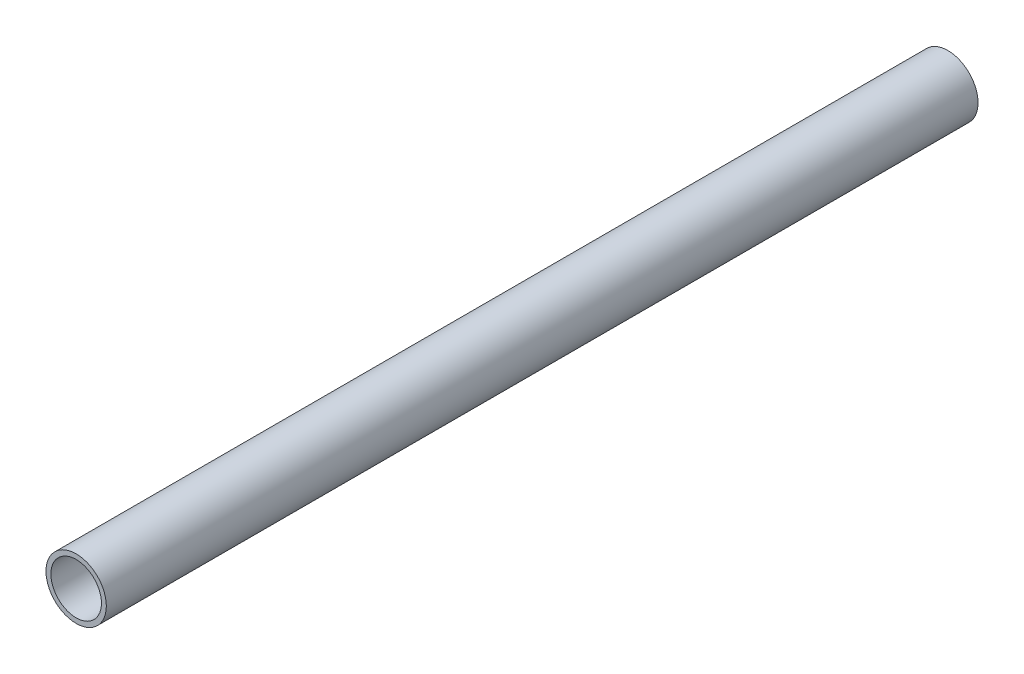
ISO-10303-21;
HEADER;
FILE_DESCRIPTION(('STEP AP214'),'2;1');
FILE_NAME('part.step','',(''),(''),'','','');
FILE_SCHEMA(('AUTOMOTIVE_DESIGN { 1 0 10303 214 1 1 1 1 }'));
ENDSEC;
DATA;
#1=APPLICATION_CONTEXT('core data for automotive mechanical design processes');
#2=APPLICATION_PROTOCOL_DEFINITION('international standard','automotive_design',2000,#1);
#3=PRODUCT_CONTEXT('',#1,'mechanical');
#4=PRODUCT('Part','Part','',(#3));
#5=PRODUCT_RELATED_PRODUCT_CATEGORY('part','',(#4));
#6=PRODUCT_DEFINITION_FORMATION('','',#4);
#7=PRODUCT_DEFINITION_CONTEXT('part definition',#1,'design');
#8=PRODUCT_DEFINITION('design','',#6,#7);
#9=PRODUCT_DEFINITION_SHAPE('','',#8);
#10=(LENGTH_UNIT() NAMED_UNIT(*) SI_UNIT(.MILLI.,.METRE.));
#11=(NAMED_UNIT(*) PLANE_ANGLE_UNIT() SI_UNIT($,.RADIAN.));
#12=(NAMED_UNIT(*) SI_UNIT($,.STERADIAN.) SOLID_ANGLE_UNIT());
#13=UNCERTAINTY_MEASURE_WITH_UNIT(LENGTH_MEASURE(1.E-05),#10,'distance_accuracy_value','');
#14=(GEOMETRIC_REPRESENTATION_CONTEXT(3) GLOBAL_UNCERTAINTY_ASSIGNED_CONTEXT((#13)) GLOBAL_UNIT_ASSIGNED_CONTEXT((#10,
#11,#12)) REPRESENTATION_CONTEXT('',''));
#15=CARTESIAN_POINT('',(0.,0.,0.));
#16=DIRECTION('',(0.,0.,1.));
#17=DIRECTION('',(1.,0.,0.));
#18=AXIS2_PLACEMENT_3D('',#15,#16,#17);
#19=CARTESIAN_POINT('',(0.,0.,258.036036458149));
#20=DIRECTION('',(0.,0.,-1.));
#21=DIRECTION('',(-1.,0.,0.));
#22=AXIS2_PLACEMENT_3D('',#19,#20,#21);
#23=CYLINDRICAL_SURFACE('',#22,8.35);
#24=CARTESIAN_POINT('',(0.,0.,-6.92840654131192));
#25=DIRECTION('',(0.,0.,-1.));
#26=DIRECTION('',(-1.,0.,0.));
#27=AXIS2_PLACEMENT_3D('',#24,#25,#26);
#28=CIRCLE('',#27,8.35);
#29=CARTESIAN_POINT('',(-8.35,0.,-6.92840654131192));
#30=VERTEX_POINT('',#29);
#31=EDGE_CURVE('E41',#30,#30,#28,.T.);
#32=ORIENTED_EDGE('',*,*,#31,.F.);
#33=EDGE_LOOP('',(#32));
#34=FACE_BOUND('',#33,.T.);
#35=CARTESIAN_POINT('',(0.,0.,234.418669966519));
#36=DIRECTION('',(0.,0.,1.));
#37=DIRECTION('',(1.,0.,0.));
#38=AXIS2_PLACEMENT_3D('',#35,#36,#37);
#39=CIRCLE('',#38,8.35);
#40=CARTESIAN_POINT('',(8.35000000000002,0.,234.418669966519));
#41=VERTEX_POINT('',#40);
#42=EDGE_CURVE('E37',#41,#41,#39,.F.);
#43=ORIENTED_EDGE('',*,*,#42,.T.);
#44=EDGE_LOOP('',(#43));
#45=FACE_BOUND('',#44,.T.);
#46=ADVANCED_FACE('F33',(#34,#45),#23,.T.);
#47=CARTESIAN_POINT('',(0.,0.,258.036036458149));
#48=DIRECTION('',(0.,0.,-1.));
#49=DIRECTION('',(-1.,0.,0.));
#50=AXIS2_PLACEMENT_3D('',#47,#48,#49);
#51=CYLINDRICAL_SURFACE('',#50,7.);
#52=CARTESIAN_POINT('',(0.,0.,-6.92840654131192));
#53=DIRECTION('',(0.,0.,-1.));
#54=DIRECTION('',(-1.,0.,0.));
#55=AXIS2_PLACEMENT_3D('',#52,#53,#54);
#56=CIRCLE('',#55,7.);
#57=CARTESIAN_POINT('',(-7.,0.,-6.92840654131192));
#58=VERTEX_POINT('',#57);
#59=EDGE_CURVE('E45',#58,#58,#56,.T.);
#60=ORIENTED_EDGE('',*,*,#59,.T.);
#61=EDGE_LOOP('',(#60));
#62=FACE_BOUND('',#61,.T.);
#63=CARTESIAN_POINT('',(0.,0.,234.418669966519));
#64=DIRECTION('',(0.,0.,1.));
#65=DIRECTION('',(1.,0.,0.));
#66=AXIS2_PLACEMENT_3D('',#63,#64,#65);
#67=CIRCLE('',#66,7.);
#68=CARTESIAN_POINT('',(7.00000000000002,0.,234.418669966519));
#69=VERTEX_POINT('',#68);
#70=EDGE_CURVE('E10',#69,#69,#67,.F.);
#71=ORIENTED_EDGE('',*,*,#70,.F.);
#72=EDGE_LOOP('',(#71));
#73=FACE_BOUND('',#72,.T.);
#74=ADVANCED_FACE('F60',(#62,#73),#51,.F.);
#75=CARTESIAN_POINT('',(0.,0.,-6.92840654131192));
#76=DIRECTION('',(0.,0.,-1.));
#77=DIRECTION('',(-1.,0.,0.));
#78=AXIS2_PLACEMENT_3D('',#75,#76,#77);
#79=PLANE('',#78);
#80=ORIENTED_EDGE('',*,*,#59,.F.);
#81=EDGE_LOOP('',(#80));
#82=FACE_BOUND('',#81,.T.);
#83=ORIENTED_EDGE('',*,*,#31,.T.);
#84=EDGE_LOOP('',(#83));
#85=FACE_BOUND('',#84,.T.);
#86=ADVANCED_FACE('F56',(#82,#85),#79,.T.);
#87=CARTESIAN_POINT('',(-4.21151881082444,-4.75243193597553,234.418669966519));
#88=DIRECTION('',(0.,0.,1.));
#89=DIRECTION('',(-0.748414478106308,0.663231308791181,0.));
#90=AXIS2_PLACEMENT_3D('',#87,#88,#89);
#91=PLANE('',#90);
#92=ORIENTED_EDGE('',*,*,#42,.F.);
#93=EDGE_LOOP('',(#92));
#94=FACE_BOUND('',#93,.T.);
#95=ORIENTED_EDGE('',*,*,#70,.T.);
#96=EDGE_LOOP('',(#95));
#97=FACE_BOUND('',#96,.T.);
#98=ADVANCED_FACE('F35',(#94,#97),#91,.T.);
#99=CLOSED_SHELL('',(#46,#74,#86,#98));
#100=MANIFOLD_SOLID_BREP('B2',#99);
#101=ADVANCED_BREP_SHAPE_REPRESENTATION('',(#18,#100),#14);
#102=SHAPE_DEFINITION_REPRESENTATION(#9,#101);
ENDSEC;
END-ISO-10303-21;
